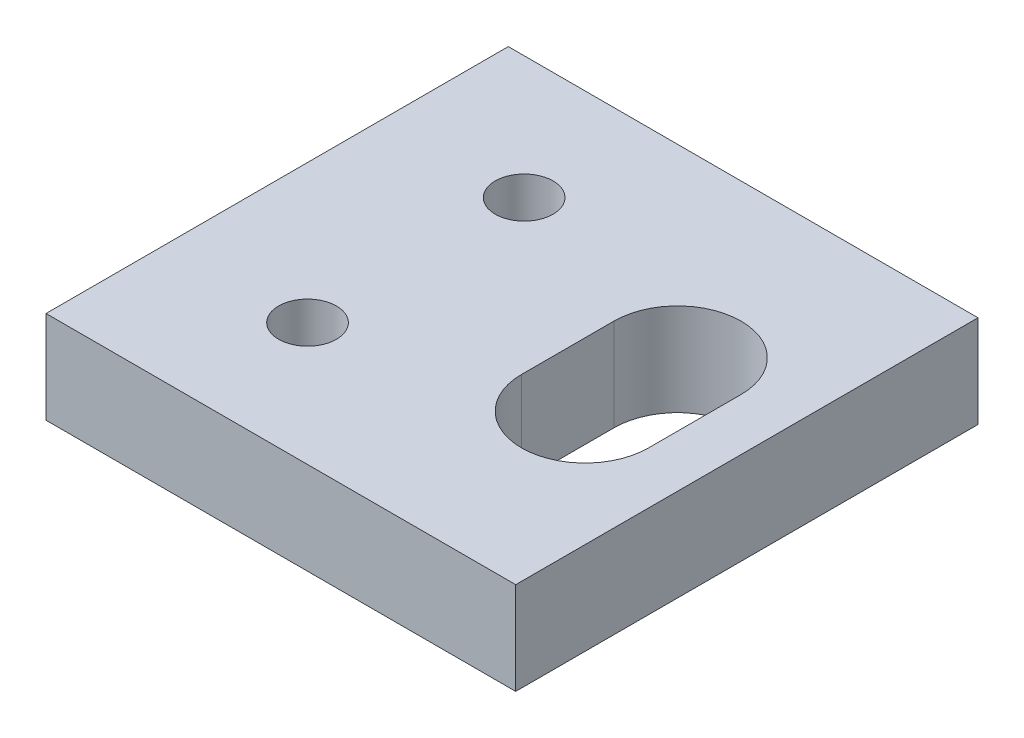
ISO-10303-21;
HEADER;
FILE_DESCRIPTION(('STEP AP214'),'2;1');
FILE_NAME('part.step','',(''),(''),'','','');
FILE_SCHEMA(('AUTOMOTIVE_DESIGN { 1 0 10303 214 1 1 1 1 }'));
ENDSEC;
DATA;
#1=APPLICATION_CONTEXT('core data for automotive mechanical design processes');
#2=APPLICATION_PROTOCOL_DEFINITION('international standard','automotive_design',2000,#1);
#3=PRODUCT_CONTEXT('',#1,'mechanical');
#4=PRODUCT('Part','Part','',(#3));
#5=PRODUCT_RELATED_PRODUCT_CATEGORY('part','',(#4));
#6=PRODUCT_DEFINITION_FORMATION('','',#4);
#7=PRODUCT_DEFINITION_CONTEXT('part definition',#1,'design');
#8=PRODUCT_DEFINITION('design','',#6,#7);
#9=PRODUCT_DEFINITION_SHAPE('','',#8);
#10=(LENGTH_UNIT() NAMED_UNIT(*) SI_UNIT(.MILLI.,.METRE.));
#11=(NAMED_UNIT(*) PLANE_ANGLE_UNIT() SI_UNIT($,.RADIAN.));
#12=(NAMED_UNIT(*) SI_UNIT($,.STERADIAN.) SOLID_ANGLE_UNIT());
#13=UNCERTAINTY_MEASURE_WITH_UNIT(LENGTH_MEASURE(1.E-05),#10,'distance_accuracy_value','');
#14=(GEOMETRIC_REPRESENTATION_CONTEXT(3) GLOBAL_UNCERTAINTY_ASSIGNED_CONTEXT((#13)) GLOBAL_UNIT_ASSIGNED_CONTEXT((#10,
#11,#12)) REPRESENTATION_CONTEXT('',''));
#15=CARTESIAN_POINT('',(0.,0.,0.));
#16=DIRECTION('',(0.,0.,1.));
#17=DIRECTION('',(1.,0.,0.));
#18=AXIS2_PLACEMENT_3D('',#15,#16,#17);
#19=CARTESIAN_POINT('',(0.,0.,0.));
#20=DIRECTION('',(-1.,0.,0.));
#21=DIRECTION('',(0.,0.,1.));
#22=AXIS2_PLACEMENT_3D('',#19,#20,#21);
#23=PLANE('',#22);
#24=DIRECTION('',(0.,0.,1.));
#25=VECTOR('',#24,1.);
#26=CARTESIAN_POINT('',(0.,4.,0.));
#27=LINE('',#26,#25);
#28=CARTESIAN_POINT('',(0.,4.,0.));
#29=VERTEX_POINT('',#28);
#30=CARTESIAN_POINT('',(0.,4.,20.));
#31=VERTEX_POINT('',#30);
#32=EDGE_CURVE('E143',#29,#31,#27,.T.);
#33=ORIENTED_EDGE('',*,*,#32,.F.);
#34=DIRECTION('',(0.,1.,0.));
#35=VECTOR('',#34,1.);
#36=CARTESIAN_POINT('',(0.,0.,0.));
#37=LINE('',#36,#35);
#38=CARTESIAN_POINT('',(0.,0.,0.));
#39=VERTEX_POINT('',#38);
#40=EDGE_CURVE('E11',#39,#29,#37,.T.);
#41=ORIENTED_EDGE('',*,*,#40,.F.);
#42=DIRECTION('',(0.,0.,1.));
#43=VECTOR('',#42,1.);
#44=CARTESIAN_POINT('',(0.,0.,0.));
#45=LINE('',#44,#43);
#46=CARTESIAN_POINT('',(0.,0.,20.));
#47=VERTEX_POINT('',#46);
#48=EDGE_CURVE('E146',#39,#47,#45,.T.);
#49=ORIENTED_EDGE('',*,*,#48,.T.);
#50=DIRECTION('',(0.,1.,0.));
#51=VECTOR('',#50,1.);
#52=CARTESIAN_POINT('',(0.,0.,20.));
#53=LINE('',#52,#51);
#54=EDGE_CURVE('E35',#47,#31,#53,.T.);
#55=ORIENTED_EDGE('',*,*,#54,.T.);
#56=EDGE_LOOP('',(#33,#41,#49,#55));
#57=FACE_BOUND('',#56,.T.);
#58=ADVANCED_FACE('F32',(#57),#23,.T.);
#59=CARTESIAN_POINT('',(20.32,0.,0.));
#60=DIRECTION('',(0.,0.,-1.));
#61=DIRECTION('',(-1.,0.,0.));
#62=AXIS2_PLACEMENT_3D('',#59,#60,#61);
#63=PLANE('',#62);
#64=DIRECTION('',(-1.,0.,0.));
#65=VECTOR('',#64,1.);
#66=CARTESIAN_POINT('',(20.32,4.,0.));
#67=LINE('',#66,#65);
#68=CARTESIAN_POINT('',(20.32,4.,0.));
#69=VERTEX_POINT('',#68);
#70=EDGE_CURVE('E150',#69,#29,#67,.T.);
#71=ORIENTED_EDGE('',*,*,#70,.F.);
#72=DIRECTION('',(0.,1.,0.));
#73=VECTOR('',#72,1.);
#74=CARTESIAN_POINT('',(20.32,0.,0.));
#75=LINE('',#74,#73);
#76=CARTESIAN_POINT('',(20.32,0.,0.));
#77=VERTEX_POINT('',#76);
#78=EDGE_CURVE('E40',#77,#69,#75,.T.);
#79=ORIENTED_EDGE('',*,*,#78,.F.);
#80=DIRECTION('',(-1.,0.,0.));
#81=VECTOR('',#80,1.);
#82=CARTESIAN_POINT('',(20.32,0.,0.));
#83=LINE('',#82,#81);
#84=EDGE_CURVE('E156',#77,#39,#83,.T.);
#85=ORIENTED_EDGE('',*,*,#84,.T.);
#86=ORIENTED_EDGE('',*,*,#40,.T.);
#87=EDGE_LOOP('',(#71,#79,#85,#86));
#88=FACE_BOUND('',#87,.T.);
#89=ADVANCED_FACE('F182',(#88),#63,.T.);
#90=CARTESIAN_POINT('',(20.32,0.,20.));
#91=DIRECTION('',(1.,0.,0.));
#92=DIRECTION('',(0.,0.,-1.));
#93=AXIS2_PLACEMENT_3D('',#90,#91,#92);
#94=PLANE('',#93);
#95=DIRECTION('',(0.,0.,-1.));
#96=VECTOR('',#95,1.);
#97=CARTESIAN_POINT('',(20.32,4.,20.));
#98=LINE('',#97,#96);
#99=CARTESIAN_POINT('',(20.32,4.,20.));
#100=VERTEX_POINT('',#99);
#101=EDGE_CURVE('E164',#100,#69,#98,.T.);
#102=ORIENTED_EDGE('',*,*,#101,.F.);
#103=DIRECTION('',(0.,1.,0.));
#104=VECTOR('',#103,1.);
#105=CARTESIAN_POINT('',(20.32,0.,20.));
#106=LINE('',#105,#104);
#107=CARTESIAN_POINT('',(20.32,0.,20.));
#108=VERTEX_POINT('',#107);
#109=EDGE_CURVE('E169',#108,#100,#106,.T.);
#110=ORIENTED_EDGE('',*,*,#109,.F.);
#111=DIRECTION('',(0.,0.,-1.));
#112=VECTOR('',#111,1.);
#113=CARTESIAN_POINT('',(20.32,0.,20.));
#114=LINE('',#113,#112);
#115=EDGE_CURVE('E153',#108,#77,#114,.T.);
#116=ORIENTED_EDGE('',*,*,#115,.T.);
#117=ORIENTED_EDGE('',*,*,#78,.T.);
#118=EDGE_LOOP('',(#102,#110,#116,#117));
#119=FACE_BOUND('',#118,.T.);
#120=ADVANCED_FACE('F187',(#119),#94,.T.);
#121=CARTESIAN_POINT('',(0.,0.,20.));
#122=DIRECTION('',(0.,0.,1.));
#123=DIRECTION('',(1.,0.,0.));
#124=AXIS2_PLACEMENT_3D('',#121,#122,#123);
#125=PLANE('',#124);
#126=DIRECTION('',(1.,0.,0.));
#127=VECTOR('',#126,1.);
#128=CARTESIAN_POINT('',(0.,4.,20.));
#129=LINE('',#128,#127);
#130=EDGE_CURVE('E161',#31,#100,#129,.T.);
#131=ORIENTED_EDGE('',*,*,#130,.F.);
#132=ORIENTED_EDGE('',*,*,#54,.F.);
#133=DIRECTION('',(1.,0.,0.));
#134=VECTOR('',#133,1.);
#135=CARTESIAN_POINT('',(0.,0.,20.));
#136=LINE('',#135,#134);
#137=EDGE_CURVE('E149',#47,#108,#136,.T.);
#138=ORIENTED_EDGE('',*,*,#137,.T.);
#139=ORIENTED_EDGE('',*,*,#109,.T.);
#140=EDGE_LOOP('',(#131,#132,#138,#139));
#141=FACE_BOUND('',#140,.T.);
#142=ADVANCED_FACE('F177',(#141),#125,.T.);
#143=CARTESIAN_POINT('',(0.,0.,0.));
#144=DIRECTION('',(0.,1.,0.));
#145=DIRECTION('',(0.,0.,1.));
#146=AXIS2_PLACEMENT_3D('',#143,#144,#145);
#147=PLANE('',#146);
#148=DIRECTION('',(0.,0.,1.));
#149=VECTOR('',#148,1.);
#150=CARTESIAN_POINT('',(12.57,0.,12.));
#151=LINE('',#150,#149);
#152=CARTESIAN_POINT('',(12.57,0.,8.));
#153=VERTEX_POINT('',#152);
#154=CARTESIAN_POINT('',(12.57,0.,12.));
#155=VERTEX_POINT('',#154);
#156=EDGE_CURVE('E105',#153,#155,#151,.T.);
#157=ORIENTED_EDGE('',*,*,#156,.T.);
#158=CARTESIAN_POINT('',(15.32,0.,12.));
#159=DIRECTION('',(0.,1.,0.));
#160=DIRECTION('',(0.,0.,1.));
#161=AXIS2_PLACEMENT_3D('',#158,#159,#160);
#162=CIRCLE('',#161,2.75);
#163=CARTESIAN_POINT('',(18.07,0.,12.));
#164=VERTEX_POINT('',#163);
#165=EDGE_CURVE('E99',#155,#164,#162,.T.);
#166=ORIENTED_EDGE('',*,*,#165,.T.);
#167=DIRECTION('',(0.,0.,-1.));
#168=VECTOR('',#167,1.);
#169=CARTESIAN_POINT('',(18.07,0.,12.));
#170=LINE('',#169,#168);
#171=CARTESIAN_POINT('',(18.07,0.,8.));
#172=VERTEX_POINT('',#171);
#173=EDGE_CURVE('E108',#164,#172,#170,.T.);
#174=ORIENTED_EDGE('',*,*,#173,.T.);
#175=CARTESIAN_POINT('',(15.32,0.,8.));
#176=DIRECTION('',(0.,1.,0.));
#177=DIRECTION('',(0.,0.,1.));
#178=AXIS2_PLACEMENT_3D('',#175,#176,#177);
#179=CIRCLE('',#178,2.75);
#180=EDGE_CURVE('E48',#172,#153,#179,.T.);
#181=ORIENTED_EDGE('',*,*,#180,.T.);
#182=EDGE_LOOP('',(#157,#166,#174,#181));
#183=FACE_BOUND('',#182,.T.);
#184=CARTESIAN_POINT('',(6.,0.,5.314));
#185=DIRECTION('',(0.,1.,0.));
#186=DIRECTION('',(0.,0.,-1.));
#187=AXIS2_PLACEMENT_3D('',#184,#185,#186);
#188=CIRCLE('',#187,1.25);
#189=CARTESIAN_POINT('',(6.,0.,4.064));
#190=VERTEX_POINT('',#189);
#191=EDGE_CURVE('E134',#190,#190,#188,.T.);
#192=ORIENTED_EDGE('',*,*,#191,.T.);
#193=EDGE_LOOP('',(#192));
#194=FACE_BOUND('',#193,.T.);
#195=CARTESIAN_POINT('',(6.,0.,14.686));
#196=DIRECTION('',(0.,1.,0.));
#197=DIRECTION('',(0.,0.,-1.));
#198=AXIS2_PLACEMENT_3D('',#195,#196,#197);
#199=CIRCLE('',#198,1.25);
#200=CARTESIAN_POINT('',(6.,0.,13.436));
#201=VERTEX_POINT('',#200);
#202=EDGE_CURVE('E140',#201,#201,#199,.T.);
#203=ORIENTED_EDGE('',*,*,#202,.T.);
#204=EDGE_LOOP('',(#203));
#205=FACE_BOUND('',#204,.T.);
#206=ORIENTED_EDGE('',*,*,#48,.F.);
#207=ORIENTED_EDGE('',*,*,#84,.F.);
#208=ORIENTED_EDGE('',*,*,#115,.F.);
#209=ORIENTED_EDGE('',*,*,#137,.F.);
#210=EDGE_LOOP('',(#206,#207,#208,#209));
#211=FACE_BOUND('',#210,.T.);
#212=ADVANCED_FACE('F112',(#183,#194,#205,#211),#147,.F.);
#213=CARTESIAN_POINT('',(0.,4.,0.));
#214=DIRECTION('',(0.,1.,0.));
#215=DIRECTION('',(0.,0.,1.));
#216=AXIS2_PLACEMENT_3D('',#213,#214,#215);
#217=PLANE('',#216);
#218=CARTESIAN_POINT('',(15.32,4.,12.));
#219=DIRECTION('',(0.,1.,0.));
#220=DIRECTION('',(0.,0.,1.));
#221=AXIS2_PLACEMENT_3D('',#218,#219,#220);
#222=CIRCLE('',#221,2.75);
#223=CARTESIAN_POINT('',(12.57,4.,12.));
#224=VERTEX_POINT('',#223);
#225=CARTESIAN_POINT('',(18.07,4.,12.));
#226=VERTEX_POINT('',#225);
#227=EDGE_CURVE('E56',#224,#226,#222,.T.);
#228=ORIENTED_EDGE('',*,*,#227,.F.);
#229=DIRECTION('',(0.,0.,1.));
#230=VECTOR('',#229,1.);
#231=CARTESIAN_POINT('',(12.57,4.,12.));
#232=LINE('',#231,#230);
#233=CARTESIAN_POINT('',(12.57,4.,8.));
#234=VERTEX_POINT('',#233);
#235=EDGE_CURVE('E115',#234,#224,#232,.T.);
#236=ORIENTED_EDGE('',*,*,#235,.F.);
#237=CARTESIAN_POINT('',(15.32,4.,8.));
#238=DIRECTION('',(0.,1.,0.));
#239=DIRECTION('',(0.,0.,1.));
#240=AXIS2_PLACEMENT_3D('',#237,#238,#239);
#241=CIRCLE('',#240,2.75);
#242=CARTESIAN_POINT('',(18.07,4.,8.));
#243=VERTEX_POINT('',#242);
#244=EDGE_CURVE('E118',#243,#234,#241,.T.);
#245=ORIENTED_EDGE('',*,*,#244,.F.);
#246=DIRECTION('',(0.,0.,-1.));
#247=VECTOR('',#246,1.);
#248=CARTESIAN_POINT('',(18.07,4.,12.));
#249=LINE('',#248,#247);
#250=EDGE_CURVE('E124',#226,#243,#249,.T.);
#251=ORIENTED_EDGE('',*,*,#250,.F.);
#252=EDGE_LOOP('',(#228,#236,#245,#251));
#253=FACE_BOUND('',#252,.T.);
#254=CARTESIAN_POINT('',(6.,4.,5.314));
#255=DIRECTION('',(0.,1.,0.));
#256=DIRECTION('',(0.,0.,-1.));
#257=AXIS2_PLACEMENT_3D('',#254,#255,#256);
#258=CIRCLE('',#257,1.25);
#259=CARTESIAN_POINT('',(6.,4.,4.064));
#260=VERTEX_POINT('',#259);
#261=EDGE_CURVE('E130',#260,#260,#258,.T.);
#262=ORIENTED_EDGE('',*,*,#261,.F.);
#263=EDGE_LOOP('',(#262));
#264=FACE_BOUND('',#263,.T.);
#265=CARTESIAN_POINT('',(6.,4.,14.686));
#266=DIRECTION('',(0.,1.,0.));
#267=DIRECTION('',(0.,0.,-1.));
#268=AXIS2_PLACEMENT_3D('',#265,#266,#267);
#269=CIRCLE('',#268,1.25);
#270=CARTESIAN_POINT('',(6.,4.,13.436));
#271=VERTEX_POINT('',#270);
#272=EDGE_CURVE('E137',#271,#271,#269,.T.);
#273=ORIENTED_EDGE('',*,*,#272,.F.);
#274=EDGE_LOOP('',(#273));
#275=FACE_BOUND('',#274,.T.);
#276=ORIENTED_EDGE('',*,*,#32,.T.);
#277=ORIENTED_EDGE('',*,*,#130,.T.);
#278=ORIENTED_EDGE('',*,*,#101,.T.);
#279=ORIENTED_EDGE('',*,*,#70,.T.);
#280=EDGE_LOOP('',(#276,#277,#278,#279));
#281=FACE_BOUND('',#280,.T.);
#282=ADVANCED_FACE('F179',(#253,#264,#275,#281),#217,.T.);
#283=CARTESIAN_POINT('',(6.,0.,14.686));
#284=DIRECTION('',(0.,1.,0.));
#285=DIRECTION('',(0.,0.,1.));
#286=AXIS2_PLACEMENT_3D('',#283,#284,#285);
#287=CYLINDRICAL_SURFACE('',#286,1.25);
#288=ORIENTED_EDGE('',*,*,#202,.F.);
#289=EDGE_LOOP('',(#288));
#290=FACE_BOUND('',#289,.T.);
#291=ORIENTED_EDGE('',*,*,#272,.T.);
#292=EDGE_LOOP('',(#291));
#293=FACE_BOUND('',#292,.T.);
#294=ADVANCED_FACE('F229',(#290,#293),#287,.F.);
#295=CARTESIAN_POINT('',(6.,0.,5.314));
#296=DIRECTION('',(0.,1.,0.));
#297=DIRECTION('',(0.,0.,1.));
#298=AXIS2_PLACEMENT_3D('',#295,#296,#297);
#299=CYLINDRICAL_SURFACE('',#298,1.25);
#300=ORIENTED_EDGE('',*,*,#191,.F.);
#301=EDGE_LOOP('',(#300));
#302=FACE_BOUND('',#301,.T.);
#303=ORIENTED_EDGE('',*,*,#261,.T.);
#304=EDGE_LOOP('',(#303));
#305=FACE_BOUND('',#304,.T.);
#306=ADVANCED_FACE('F239',(#302,#305),#299,.F.);
#307=CARTESIAN_POINT('',(15.32,0.,12.));
#308=DIRECTION('',(0.,1.,0.));
#309=DIRECTION('',(0.,0.,1.));
#310=AXIS2_PLACEMENT_3D('',#307,#308,#309);
#311=CYLINDRICAL_SURFACE('',#310,2.75);
#312=ORIENTED_EDGE('',*,*,#227,.T.);
#313=DIRECTION('',(0.,1.,0.));
#314=VECTOR('',#313,1.);
#315=CARTESIAN_POINT('',(18.07,0.,12.));
#316=LINE('',#315,#314);
#317=EDGE_CURVE('E95',#164,#226,#316,.T.);
#318=ORIENTED_EDGE('',*,*,#317,.F.);
#319=ORIENTED_EDGE('',*,*,#165,.F.);
#320=DIRECTION('',(0.,1.,0.));
#321=VECTOR('',#320,1.);
#322=CARTESIAN_POINT('',(12.57,0.,12.));
#323=LINE('',#322,#321);
#324=EDGE_CURVE('E128',#155,#224,#323,.T.);
#325=ORIENTED_EDGE('',*,*,#324,.T.);
#326=EDGE_LOOP('',(#312,#318,#319,#325));
#327=FACE_BOUND('',#326,.T.);
#328=ADVANCED_FACE('F97',(#327),#311,.F.);
#329=CARTESIAN_POINT('',(12.57,0.,12.));
#330=DIRECTION('',(-1.,0.,0.));
#331=DIRECTION('',(0.,0.,1.));
#332=AXIS2_PLACEMENT_3D('',#329,#330,#331);
#333=PLANE('',#332);
#334=ORIENTED_EDGE('',*,*,#235,.T.);
#335=ORIENTED_EDGE('',*,*,#324,.F.);
#336=ORIENTED_EDGE('',*,*,#156,.F.);
#337=DIRECTION('',(0.,1.,0.));
#338=VECTOR('',#337,1.);
#339=CARTESIAN_POINT('',(12.57,0.,8.));
#340=LINE('',#339,#338);
#341=EDGE_CURVE('E131',#153,#234,#340,.T.);
#342=ORIENTED_EDGE('',*,*,#341,.T.);
#343=EDGE_LOOP('',(#334,#335,#336,#342));
#344=FACE_BOUND('',#343,.T.);
#345=ADVANCED_FACE('F258',(#344),#333,.F.);
#346=CARTESIAN_POINT('',(15.32,0.,8.));
#347=DIRECTION('',(0.,1.,0.));
#348=DIRECTION('',(0.,0.,1.));
#349=AXIS2_PLACEMENT_3D('',#346,#347,#348);
#350=CYLINDRICAL_SURFACE('',#349,2.75);
#351=ORIENTED_EDGE('',*,*,#244,.T.);
#352=ORIENTED_EDGE('',*,*,#341,.F.);
#353=ORIENTED_EDGE('',*,*,#180,.F.);
#354=DIRECTION('',(0.,1.,0.));
#355=VECTOR('',#354,1.);
#356=CARTESIAN_POINT('',(18.07,0.,8.));
#357=LINE('',#356,#355);
#358=EDGE_CURVE('E104',#172,#243,#357,.T.);
#359=ORIENTED_EDGE('',*,*,#358,.T.);
#360=EDGE_LOOP('',(#351,#352,#353,#359));
#361=FACE_BOUND('',#360,.T.);
#362=ADVANCED_FACE('F267',(#361),#350,.F.);
#363=CARTESIAN_POINT('',(18.07,0.,12.));
#364=DIRECTION('',(1.,0.,0.));
#365=DIRECTION('',(0.,0.,-1.));
#366=AXIS2_PLACEMENT_3D('',#363,#364,#365);
#367=PLANE('',#366);
#368=ORIENTED_EDGE('',*,*,#250,.T.);
#369=ORIENTED_EDGE('',*,*,#358,.F.);
#370=ORIENTED_EDGE('',*,*,#173,.F.);
#371=ORIENTED_EDGE('',*,*,#317,.T.);
#372=EDGE_LOOP('',(#368,#369,#370,#371));
#373=FACE_BOUND('',#372,.T.);
#374=ADVANCED_FACE('F109',(#373),#367,.F.);
#375=CLOSED_SHELL('',(#58,#89,#120,#142,#212,#282,#294,#306,#328,#345,#362,#374));
#376=MANIFOLD_SOLID_BREP('B2',#375);
#377=ADVANCED_BREP_SHAPE_REPRESENTATION('',(#18,#376),#14);
#378=SHAPE_DEFINITION_REPRESENTATION(#9,#377);
ENDSEC;
END-ISO-10303-21;
